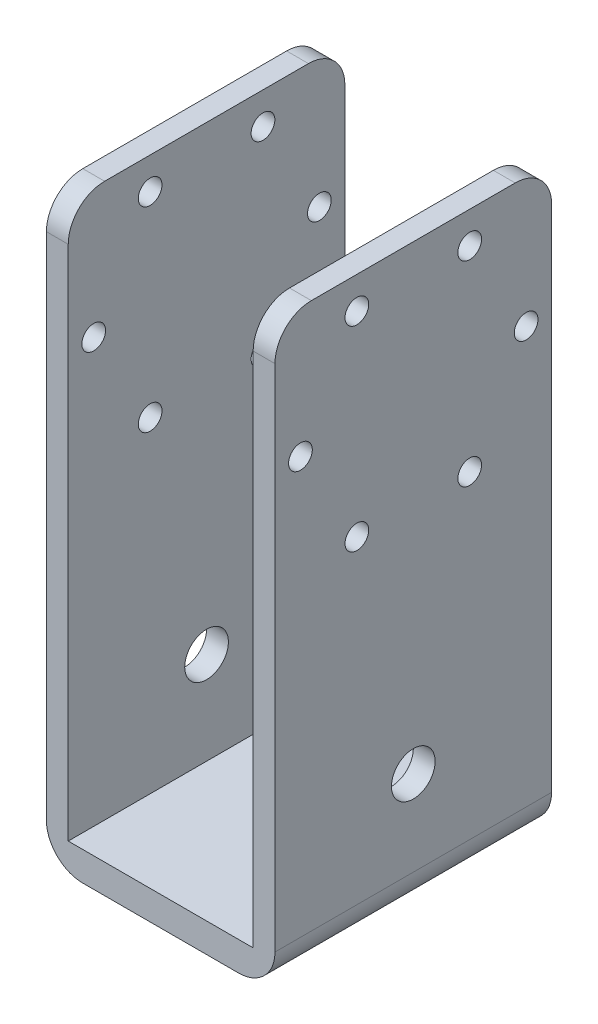
ISO-10303-21;
HEADER;
FILE_DESCRIPTION(('STEP AP214'),'2;1');
FILE_NAME('part.step','',(''),(''),'','','');
FILE_SCHEMA(('AUTOMOTIVE_DESIGN { 1 0 10303 214 1 1 1 1 }'));
ENDSEC;
DATA;
#1=APPLICATION_CONTEXT('core data for automotive mechanical design processes');
#2=APPLICATION_PROTOCOL_DEFINITION('international standard','automotive_design',2000,#1);
#3=PRODUCT_CONTEXT('',#1,'mechanical');
#4=PRODUCT('Part','Part','',(#3));
#5=PRODUCT_RELATED_PRODUCT_CATEGORY('part','',(#4));
#6=PRODUCT_DEFINITION_FORMATION('','',#4);
#7=PRODUCT_DEFINITION_CONTEXT('part definition',#1,'design');
#8=PRODUCT_DEFINITION('design','',#6,#7);
#9=PRODUCT_DEFINITION_SHAPE('','',#8);
#10=(LENGTH_UNIT() NAMED_UNIT(*) SI_UNIT(.MILLI.,.METRE.));
#11=(NAMED_UNIT(*) PLANE_ANGLE_UNIT() SI_UNIT($,.RADIAN.));
#12=(NAMED_UNIT(*) SI_UNIT($,.STERADIAN.) SOLID_ANGLE_UNIT());
#13=UNCERTAINTY_MEASURE_WITH_UNIT(LENGTH_MEASURE(1.E-05),#10,'distance_accuracy_value','');
#14=(GEOMETRIC_REPRESENTATION_CONTEXT(3) GLOBAL_UNCERTAINTY_ASSIGNED_CONTEXT((#13)) GLOBAL_UNIT_ASSIGNED_CONTEXT((#10,
#11,#12)) REPRESENTATION_CONTEXT('',''));
#15=CARTESIAN_POINT('',(0.,0.,0.));
#16=DIRECTION('',(0.,0.,1.));
#17=DIRECTION('',(1.,0.,0.));
#18=AXIS2_PLACEMENT_3D('',#15,#16,#17);
#19=CARTESIAN_POINT('',(-15.7,80.,19.));
#20=DIRECTION('',(1.,0.,0.));
#21=DIRECTION('',(0.,1.,0.));
#22=AXIS2_PLACEMENT_3D('',#19,#20,#21);
#23=PLANE('',#22);
#24=CARTESIAN_POINT('',(-15.7,16.7,0.));
#25=DIRECTION('',(1.,0.,0.));
#26=DIRECTION('',(0.,1.,0.));
#27=AXIS2_PLACEMENT_3D('',#24,#25,#26);
#28=CIRCLE('',#27,3.);
#29=CARTESIAN_POINT('',(-15.7,19.7,0.));
#30=VERTEX_POINT('',#29);
#31=EDGE_CURVE('E353',#30,#30,#28,.T.);
#32=ORIENTED_EDGE('',*,*,#31,.T.);
#33=EDGE_LOOP('',(#32));
#34=FACE_BOUND('',#33,.T.);
#35=CARTESIAN_POINT('',(-15.7,48.77,7.75000000000001));
#36=DIRECTION('',(1.,0.,0.));
#37=DIRECTION('',(0.,1.,0.));
#38=AXIS2_PLACEMENT_3D('',#35,#36,#37);
#39=CIRCLE('',#38,1.63);
#40=CARTESIAN_POINT('',(-15.7,50.4,7.75000000000001));
#41=VERTEX_POINT('',#40);
#42=EDGE_CURVE('E330',#41,#41,#39,.T.);
#43=ORIENTED_EDGE('',*,*,#42,.T.);
#44=EDGE_LOOP('',(#43));
#45=FACE_BOUND('',#44,.T.);
#46=CARTESIAN_POINT('',(-15.7,62.2,-15.5));
#47=DIRECTION('',(1.,0.,0.));
#48=DIRECTION('',(0.,-1.,0.));
#49=AXIS2_PLACEMENT_3D('',#46,#47,#48);
#50=CIRCLE('',#49,1.63);
#51=CARTESIAN_POINT('',(-15.7,60.57,-15.5));
#52=VERTEX_POINT('',#51);
#53=EDGE_CURVE('E337',#52,#52,#50,.T.);
#54=ORIENTED_EDGE('',*,*,#53,.T.);
#55=EDGE_LOOP('',(#54));
#56=FACE_BOUND('',#55,.T.);
#57=CARTESIAN_POINT('',(-15.7,62.2,15.5));
#58=DIRECTION('',(1.,0.,0.));
#59=DIRECTION('',(0.,1.,0.));
#60=AXIS2_PLACEMENT_3D('',#57,#58,#59);
#61=CIRCLE('',#60,1.63);
#62=CARTESIAN_POINT('',(-15.7,63.83,15.5));
#63=VERTEX_POINT('',#62);
#64=EDGE_CURVE('E318',#63,#63,#61,.T.);
#65=ORIENTED_EDGE('',*,*,#64,.T.);
#66=EDGE_LOOP('',(#65));
#67=FACE_BOUND('',#66,.T.);
#68=CARTESIAN_POINT('',(-15.7,75.63,-7.75));
#69=DIRECTION('',(1.,0.,0.));
#70=DIRECTION('',(0.,1.,0.));
#71=AXIS2_PLACEMENT_3D('',#68,#69,#70);
#72=CIRCLE('',#71,1.63);
#73=CARTESIAN_POINT('',(-15.7,77.26,-7.75));
#74=VERTEX_POINT('',#73);
#75=EDGE_CURVE('E325',#74,#74,#72,.T.);
#76=ORIENTED_EDGE('',*,*,#75,.T.);
#77=EDGE_LOOP('',(#76));
#78=FACE_BOUND('',#77,.T.);
#79=CARTESIAN_POINT('',(-15.7,48.77,-7.75000000000001));
#80=DIRECTION('',(1.,0.,0.));
#81=DIRECTION('',(0.,-1.,0.));
#82=AXIS2_PLACEMENT_3D('',#79,#80,#81);
#83=CIRCLE('',#82,1.63);
#84=CARTESIAN_POINT('',(-15.7,47.14,-7.75000000000001));
#85=VERTEX_POINT('',#84);
#86=EDGE_CURVE('E342',#85,#85,#83,.T.);
#87=ORIENTED_EDGE('',*,*,#86,.T.);
#88=EDGE_LOOP('',(#87));
#89=FACE_BOUND('',#88,.T.);
#90=CARTESIAN_POINT('',(-15.7,75.63,7.75000000000001));
#91=DIRECTION('',(1.,0.,0.));
#92=DIRECTION('',(0.,1.,0.));
#93=AXIS2_PLACEMENT_3D('',#90,#91,#92);
#94=CIRCLE('',#93,1.63);
#95=CARTESIAN_POINT('',(-15.7,77.26,7.75000000000001));
#96=VERTEX_POINT('',#95);
#97=EDGE_CURVE('E205',#96,#96,#94,.T.);
#98=ORIENTED_EDGE('',*,*,#97,.T.);
#99=EDGE_LOOP('',(#98));
#100=FACE_BOUND('',#99,.T.);
#101=DIRECTION('',(0.,-1.,0.));
#102=VECTOR('',#101,1.);
#103=CARTESIAN_POINT('',(-15.7,80.,-19.));
#104=LINE('',#103,#102);
#105=CARTESIAN_POINT('',(-15.7,75.,-19.));
#106=VERTEX_POINT('',#105);
#107=CARTESIAN_POINT('',(-15.7,5.,-19.));
#108=VERTEX_POINT('',#107);
#109=EDGE_CURVE('E173',#106,#108,#104,.T.);
#110=ORIENTED_EDGE('',*,*,#109,.T.);
#111=DIRECTION('',(0.,0.,-1.));
#112=VECTOR('',#111,1.);
#113=CARTESIAN_POINT('',(-15.7,5.,19.));
#114=LINE('',#113,#112);
#115=CARTESIAN_POINT('',(-15.7,5.,19.));
#116=VERTEX_POINT('',#115);
#117=EDGE_CURVE('E241',#108,#116,#114,.F.);
#118=ORIENTED_EDGE('',*,*,#117,.T.);
#119=DIRECTION('',(0.,-1.,0.));
#120=VECTOR('',#119,1.);
#121=CARTESIAN_POINT('',(-15.7,80.,19.));
#122=LINE('',#121,#120);
#123=CARTESIAN_POINT('',(-15.7,75.,19.));
#124=VERTEX_POINT('',#123);
#125=EDGE_CURVE('E189',#124,#116,#122,.T.);
#126=ORIENTED_EDGE('',*,*,#125,.F.);
#127=CARTESIAN_POINT('',(-15.7,75.,14.));
#128=DIRECTION('',(1.,0.,0.));
#129=DIRECTION('',(0.,1.,0.));
#130=AXIS2_PLACEMENT_3D('',#127,#128,#129);
#131=CIRCLE('',#130,5.);
#132=CARTESIAN_POINT('',(-15.7,80.,14.));
#133=VERTEX_POINT('',#132);
#134=EDGE_CURVE('E239',#124,#133,#131,.F.);
#135=ORIENTED_EDGE('',*,*,#134,.T.);
#136=DIRECTION('',(0.,0.,-1.));
#137=VECTOR('',#136,1.);
#138=CARTESIAN_POINT('',(-15.7,80.,19.));
#139=LINE('',#138,#137);
#140=CARTESIAN_POINT('',(-15.7,80.,-14.));
#141=VERTEX_POINT('',#140);
#142=EDGE_CURVE('E169',#133,#141,#139,.T.);
#143=ORIENTED_EDGE('',*,*,#142,.T.);
#144=CARTESIAN_POINT('',(-15.7,75.,-14.));
#145=DIRECTION('',(1.,0.,0.));
#146=DIRECTION('',(0.,1.,0.));
#147=AXIS2_PLACEMENT_3D('',#144,#145,#146);
#148=CIRCLE('',#147,5.);
#149=EDGE_CURVE('E237',#141,#106,#148,.F.);
#150=ORIENTED_EDGE('',*,*,#149,.T.);
#151=EDGE_LOOP('',(#110,#118,#126,#135,#143,#150));
#152=FACE_BOUND('',#151,.T.);
#153=ADVANCED_FACE('F41',(#34,#45,#56,#67,#78,#89,#100,#152),#23,.F.);
#154=CARTESIAN_POINT('',(-15.7,0.,19.));
#155=DIRECTION('',(0.,1.,0.));
#156=DIRECTION('',(-1.,0.,0.));
#157=AXIS2_PLACEMENT_3D('',#154,#155,#156);
#158=PLANE('',#157);
#159=DIRECTION('',(1.,0.,0.));
#160=VECTOR('',#159,1.);
#161=CARTESIAN_POINT('',(-15.7,0.,19.));
#162=LINE('',#161,#160);
#163=CARTESIAN_POINT('',(-10.7,0.,19.));
#164=VERTEX_POINT('',#163);
#165=CARTESIAN_POINT('',(10.7,0.,19.));
#166=VERTEX_POINT('',#165);
#167=EDGE_CURVE('E296',#164,#166,#162,.T.);
#168=ORIENTED_EDGE('',*,*,#167,.F.);
#169=DIRECTION('',(0.,0.,-1.));
#170=VECTOR('',#169,1.);
#171=CARTESIAN_POINT('',(-10.7,0.,19.));
#172=LINE('',#171,#170);
#173=CARTESIAN_POINT('',(-10.7,0.,-19.));
#174=VERTEX_POINT('',#173);
#175=EDGE_CURVE('E226',#164,#174,#172,.T.);
#176=ORIENTED_EDGE('',*,*,#175,.T.);
#177=DIRECTION('',(1.,0.,0.));
#178=VECTOR('',#177,1.);
#179=CARTESIAN_POINT('',(-15.7,0.,-19.));
#180=LINE('',#179,#178);
#181=CARTESIAN_POINT('',(10.7,0.,-19.));
#182=VERTEX_POINT('',#181);
#183=EDGE_CURVE('E176',#174,#182,#180,.T.);
#184=ORIENTED_EDGE('',*,*,#183,.T.);
#185=DIRECTION('',(0.,0.,-1.));
#186=VECTOR('',#185,1.);
#187=CARTESIAN_POINT('',(10.7,0.,19.));
#188=LINE('',#187,#186);
#189=EDGE_CURVE('E200',#182,#166,#188,.F.);
#190=ORIENTED_EDGE('',*,*,#189,.T.);
#191=EDGE_LOOP('',(#168,#176,#184,#190));
#192=FACE_BOUND('',#191,.T.);
#193=ADVANCED_FACE('F291',(#192),#158,.F.);
#194=CARTESIAN_POINT('',(15.7,80.,19.));
#195=DIRECTION('',(-1.,0.,0.));
#196=DIRECTION('',(0.,-1.,0.));
#197=AXIS2_PLACEMENT_3D('',#194,#195,#196);
#198=PLANE('',#197);
#199=CARTESIAN_POINT('',(15.7,16.7,0.));
#200=DIRECTION('',(1.,0.,0.));
#201=DIRECTION('',(0.,1.,0.));
#202=AXIS2_PLACEMENT_3D('',#199,#200,#201);
#203=CIRCLE('',#202,3.);
#204=CARTESIAN_POINT('',(15.7,19.7,0.));
#205=VERTEX_POINT('',#204);
#206=EDGE_CURVE('E350',#205,#205,#203,.T.);
#207=ORIENTED_EDGE('',*,*,#206,.F.);
#208=EDGE_LOOP('',(#207));
#209=FACE_BOUND('',#208,.T.);
#210=CARTESIAN_POINT('',(15.7,48.77,7.75000000000001));
#211=DIRECTION('',(1.,0.,0.));
#212=DIRECTION('',(0.,1.,0.));
#213=AXIS2_PLACEMENT_3D('',#210,#211,#212);
#214=CIRCLE('',#213,1.63);
#215=CARTESIAN_POINT('',(15.7,50.4,7.75000000000001));
#216=VERTEX_POINT('',#215);
#217=EDGE_CURVE('E333',#216,#216,#214,.T.);
#218=ORIENTED_EDGE('',*,*,#217,.F.);
#219=EDGE_LOOP('',(#218));
#220=FACE_BOUND('',#219,.T.);
#221=CARTESIAN_POINT('',(15.7,62.2,-15.5));
#222=DIRECTION('',(1.,0.,0.));
#223=DIRECTION('',(0.,-1.,0.));
#224=AXIS2_PLACEMENT_3D('',#221,#222,#223);
#225=CIRCLE('',#224,1.63);
#226=CARTESIAN_POINT('',(15.7,60.57,-15.5));
#227=VERTEX_POINT('',#226);
#228=EDGE_CURVE('E322',#227,#227,#225,.T.);
#229=ORIENTED_EDGE('',*,*,#228,.F.);
#230=EDGE_LOOP('',(#229));
#231=FACE_BOUND('',#230,.T.);
#232=CARTESIAN_POINT('',(15.7,62.2,15.5));
#233=DIRECTION('',(1.,0.,0.));
#234=DIRECTION('',(0.,1.,0.));
#235=AXIS2_PLACEMENT_3D('',#232,#233,#234);
#236=CIRCLE('',#235,1.63);
#237=CARTESIAN_POINT('',(15.7,63.83,15.5));
#238=VERTEX_POINT('',#237);
#239=EDGE_CURVE('E321',#238,#238,#236,.T.);
#240=ORIENTED_EDGE('',*,*,#239,.F.);
#241=EDGE_LOOP('',(#240));
#242=FACE_BOUND('',#241,.T.);
#243=CARTESIAN_POINT('',(15.7,75.63,-7.75));
#244=DIRECTION('',(1.,0.,0.));
#245=DIRECTION('',(0.,1.,0.));
#246=AXIS2_PLACEMENT_3D('',#243,#244,#245);
#247=CIRCLE('',#246,1.63);
#248=CARTESIAN_POINT('',(15.7,77.26,-7.75));
#249=VERTEX_POINT('',#248);
#250=EDGE_CURVE('E315',#249,#249,#247,.T.);
#251=ORIENTED_EDGE('',*,*,#250,.F.);
#252=EDGE_LOOP('',(#251));
#253=FACE_BOUND('',#252,.T.);
#254=CARTESIAN_POINT('',(15.7,48.77,-7.75000000000001));
#255=DIRECTION('',(1.,0.,0.));
#256=DIRECTION('',(0.,-1.,0.));
#257=AXIS2_PLACEMENT_3D('',#254,#255,#256);
#258=CIRCLE('',#257,1.63);
#259=CARTESIAN_POINT('',(15.7,47.14,-7.75000000000001));
#260=VERTEX_POINT('',#259);
#261=EDGE_CURVE('E334',#260,#260,#258,.T.);
#262=ORIENTED_EDGE('',*,*,#261,.F.);
#263=EDGE_LOOP('',(#262));
#264=FACE_BOUND('',#263,.T.);
#265=CARTESIAN_POINT('',(15.7,75.63,7.75000000000001));
#266=DIRECTION('',(1.,0.,0.));
#267=DIRECTION('',(0.,1.,0.));
#268=AXIS2_PLACEMENT_3D('',#265,#266,#267);
#269=CIRCLE('',#268,1.63);
#270=CARTESIAN_POINT('',(15.7,77.26,7.75000000000001));
#271=VERTEX_POINT('',#270);
#272=EDGE_CURVE('E312',#271,#271,#269,.T.);
#273=ORIENTED_EDGE('',*,*,#272,.F.);
#274=EDGE_LOOP('',(#273));
#275=FACE_BOUND('',#274,.T.);
#276=DIRECTION('',(0.,1.,0.));
#277=VECTOR('',#276,1.);
#278=CARTESIAN_POINT('',(15.7,80.,19.));
#279=LINE('',#278,#277);
#280=CARTESIAN_POINT('',(15.7,5.,19.));
#281=VERTEX_POINT('',#280);
#282=CARTESIAN_POINT('',(15.7,75.,19.));
#283=VERTEX_POINT('',#282);
#284=EDGE_CURVE('E152',#281,#283,#279,.T.);
#285=ORIENTED_EDGE('',*,*,#284,.F.);
#286=DIRECTION('',(0.,0.,-1.));
#287=VECTOR('',#286,1.);
#288=CARTESIAN_POINT('',(15.7,5.,19.));
#289=LINE('',#288,#287);
#290=CARTESIAN_POINT('',(15.7,5.,-19.));
#291=VERTEX_POINT('',#290);
#292=EDGE_CURVE('E255',#281,#291,#289,.T.);
#293=ORIENTED_EDGE('',*,*,#292,.T.);
#294=DIRECTION('',(0.,1.,0.));
#295=VECTOR('',#294,1.);
#296=CARTESIAN_POINT('',(15.7,80.,-19.));
#297=LINE('',#296,#295);
#298=CARTESIAN_POINT('',(15.7,75.,-19.));
#299=VERTEX_POINT('',#298);
#300=EDGE_CURVE('E180',#291,#299,#297,.T.);
#301=ORIENTED_EDGE('',*,*,#300,.T.);
#302=CARTESIAN_POINT('',(15.7,75.,-14.));
#303=DIRECTION('',(-1.,0.,0.));
#304=DIRECTION('',(0.,-1.,0.));
#305=AXIS2_PLACEMENT_3D('',#302,#303,#304);
#306=CIRCLE('',#305,5.);
#307=CARTESIAN_POINT('',(15.7,80.,-14.));
#308=VERTEX_POINT('',#307);
#309=EDGE_CURVE('E253',#299,#308,#306,.F.);
#310=ORIENTED_EDGE('',*,*,#309,.T.);
#311=DIRECTION('',(0.,0.,-1.));
#312=VECTOR('',#311,1.);
#313=CARTESIAN_POINT('',(15.7,80.,19.));
#314=LINE('',#313,#312);
#315=CARTESIAN_POINT('',(15.7,80.,14.));
#316=VERTEX_POINT('',#315);
#317=EDGE_CURVE('E197',#316,#308,#314,.T.);
#318=ORIENTED_EDGE('',*,*,#317,.F.);
#319=CARTESIAN_POINT('',(15.7,75.,14.));
#320=DIRECTION('',(-1.,0.,0.));
#321=DIRECTION('',(0.,-1.,0.));
#322=AXIS2_PLACEMENT_3D('',#319,#320,#321);
#323=CIRCLE('',#322,5.);
#324=EDGE_CURVE('E251',#316,#283,#323,.F.);
#325=ORIENTED_EDGE('',*,*,#324,.T.);
#326=EDGE_LOOP('',(#285,#293,#301,#310,#318,#325));
#327=FACE_BOUND('',#326,.T.);
#328=ADVANCED_FACE('F284',(#209,#220,#231,#242,#253,#264,#275,#327),#198,.F.);
#329=CARTESIAN_POINT('',(15.7,80.,19.));
#330=DIRECTION('',(0.,-1.,0.));
#331=DIRECTION('',(0.,0.,-1.));
#332=AXIS2_PLACEMENT_3D('',#329,#330,#331);
#333=PLANE('',#332);
#334=ORIENTED_EDGE('',*,*,#317,.T.);
#335=DIRECTION('',(-1.,0.,0.));
#336=VECTOR('',#335,1.);
#337=CARTESIAN_POINT('',(15.7,80.,-14.));
#338=LINE('',#337,#336);
#339=CARTESIAN_POINT('',(12.7,80.,-14.));
#340=VERTEX_POINT('',#339);
#341=EDGE_CURVE('E269',#308,#340,#338,.T.);
#342=ORIENTED_EDGE('',*,*,#341,.T.);
#343=DIRECTION('',(0.,0.,-1.));
#344=VECTOR('',#343,1.);
#345=CARTESIAN_POINT('',(12.7,80.,19.));
#346=LINE('',#345,#344);
#347=CARTESIAN_POINT('',(12.7,80.,14.));
#348=VERTEX_POINT('',#347);
#349=EDGE_CURVE('E161',#348,#340,#346,.T.);
#350=ORIENTED_EDGE('',*,*,#349,.F.);
#351=DIRECTION('',(-1.,0.,0.));
#352=VECTOR('',#351,1.);
#353=CARTESIAN_POINT('',(15.7,80.,14.));
#354=LINE('',#353,#352);
#355=EDGE_CURVE('E267',#348,#316,#354,.F.);
#356=ORIENTED_EDGE('',*,*,#355,.T.);
#357=EDGE_LOOP('',(#334,#342,#350,#356));
#358=FACE_BOUND('',#357,.T.);
#359=ADVANCED_FACE('F272',(#358),#333,.F.);
#360=CARTESIAN_POINT('',(12.7,80.,19.));
#361=DIRECTION('',(1.,0.,0.));
#362=DIRECTION('',(0.,1.,0.));
#363=AXIS2_PLACEMENT_3D('',#360,#361,#362);
#364=PLANE('',#363);
#365=CARTESIAN_POINT('',(12.7,16.7,0.));
#366=DIRECTION('',(1.,0.,0.));
#367=DIRECTION('',(0.,1.,0.));
#368=AXIS2_PLACEMENT_3D('',#365,#366,#367);
#369=CIRCLE('',#368,3.);
#370=CARTESIAN_POINT('',(12.7,19.7,0.));
#371=VERTEX_POINT('',#370);
#372=EDGE_CURVE('E345',#371,#371,#369,.T.);
#373=ORIENTED_EDGE('',*,*,#372,.T.);
#374=EDGE_LOOP('',(#373));
#375=FACE_BOUND('',#374,.T.);
#376=CARTESIAN_POINT('',(12.7,48.77,7.75000000000001));
#377=DIRECTION('',(1.,0.,0.));
#378=DIRECTION('',(0.,1.,0.));
#379=AXIS2_PLACEMENT_3D('',#376,#377,#378);
#380=CIRCLE('',#379,1.63);
#381=CARTESIAN_POINT('',(12.7,50.4,7.75000000000001));
#382=VERTEX_POINT('',#381);
#383=EDGE_CURVE('E177',#382,#382,#380,.T.);
#384=ORIENTED_EDGE('',*,*,#383,.T.);
#385=EDGE_LOOP('',(#384));
#386=FACE_BOUND('',#385,.T.);
#387=CARTESIAN_POINT('',(12.7,62.2,-15.5));
#388=DIRECTION('',(1.,0.,0.));
#389=DIRECTION('',(0.,1.,0.));
#390=AXIS2_PLACEMENT_3D('',#387,#388,#389);
#391=CIRCLE('',#390,1.63);
#392=CARTESIAN_POINT('',(12.7,63.83,-15.5));
#393=VERTEX_POINT('',#392);
#394=EDGE_CURVE('E221',#393,#393,#391,.T.);
#395=ORIENTED_EDGE('',*,*,#394,.T.);
#396=EDGE_LOOP('',(#395));
#397=FACE_BOUND('',#396,.T.);
#398=CARTESIAN_POINT('',(12.7,62.2,15.5));
#399=DIRECTION('',(1.,0.,0.));
#400=DIRECTION('',(0.,1.,0.));
#401=AXIS2_PLACEMENT_3D('',#398,#399,#400);
#402=CIRCLE('',#401,1.63);
#403=CARTESIAN_POINT('',(12.7,63.83,15.5));
#404=VERTEX_POINT('',#403);
#405=EDGE_CURVE('E217',#404,#404,#402,.T.);
#406=ORIENTED_EDGE('',*,*,#405,.T.);
#407=EDGE_LOOP('',(#406));
#408=FACE_BOUND('',#407,.T.);
#409=CARTESIAN_POINT('',(12.7,75.63,-7.75));
#410=DIRECTION('',(1.,0.,0.));
#411=DIRECTION('',(0.,1.,0.));
#412=AXIS2_PLACEMENT_3D('',#409,#410,#411);
#413=CIRCLE('',#412,1.63);
#414=CARTESIAN_POINT('',(12.7,77.26,-7.75));
#415=VERTEX_POINT('',#414);
#416=EDGE_CURVE('E213',#415,#415,#413,.T.);
#417=ORIENTED_EDGE('',*,*,#416,.T.);
#418=EDGE_LOOP('',(#417));
#419=FACE_BOUND('',#418,.T.);
#420=CARTESIAN_POINT('',(12.7,48.77,-7.75000000000001));
#421=DIRECTION('',(1.,0.,0.));
#422=DIRECTION('',(0.,1.,0.));
#423=AXIS2_PLACEMENT_3D('',#420,#421,#422);
#424=CIRCLE('',#423,1.63);
#425=CARTESIAN_POINT('',(12.7,50.4,-7.75000000000001));
#426=VERTEX_POINT('',#425);
#427=EDGE_CURVE('E209',#426,#426,#424,.T.);
#428=ORIENTED_EDGE('',*,*,#427,.T.);
#429=EDGE_LOOP('',(#428));
#430=FACE_BOUND('',#429,.T.);
#431=CARTESIAN_POINT('',(12.7,75.63,7.75000000000001));
#432=DIRECTION('',(1.,0.,0.));
#433=DIRECTION('',(0.,1.,0.));
#434=AXIS2_PLACEMENT_3D('',#431,#432,#433);
#435=CIRCLE('',#434,1.63);
#436=CARTESIAN_POINT('',(12.7,77.26,7.75000000000001));
#437=VERTEX_POINT('',#436);
#438=EDGE_CURVE('E204',#437,#437,#435,.T.);
#439=ORIENTED_EDGE('',*,*,#438,.T.);
#440=EDGE_LOOP('',(#439));
#441=FACE_BOUND('',#440,.T.);
#442=ORIENTED_EDGE('',*,*,#349,.T.);
#443=CARTESIAN_POINT('',(12.7,75.,-14.));
#444=DIRECTION('',(1.,0.,0.));
#445=DIRECTION('',(0.,1.,0.));
#446=AXIS2_PLACEMENT_3D('',#443,#444,#445);
#447=CIRCLE('',#446,5.);
#448=CARTESIAN_POINT('',(12.7,75.,-19.));
#449=VERTEX_POINT('',#448);
#450=EDGE_CURVE('E11',#340,#449,#447,.F.);
#451=ORIENTED_EDGE('',*,*,#450,.T.);
#452=DIRECTION('',(0.,-1.,0.));
#453=VECTOR('',#452,1.);
#454=CARTESIAN_POINT('',(12.7,80.,-19.));
#455=LINE('',#454,#453);
#456=CARTESIAN_POINT('',(12.7,4.,-19.));
#457=VERTEX_POINT('',#456);
#458=EDGE_CURVE('E158',#449,#457,#455,.T.);
#459=ORIENTED_EDGE('',*,*,#458,.T.);
#460=DIRECTION('',(0.,0.,-1.));
#461=VECTOR('',#460,1.);
#462=CARTESIAN_POINT('',(12.7,4.,19.));
#463=LINE('',#462,#461);
#464=CARTESIAN_POINT('',(12.7,4.,19.));
#465=VERTEX_POINT('',#464);
#466=EDGE_CURVE('E155',#465,#457,#463,.T.);
#467=ORIENTED_EDGE('',*,*,#466,.F.);
#468=DIRECTION('',(0.,-1.,0.));
#469=VECTOR('',#468,1.);
#470=CARTESIAN_POINT('',(12.7,80.,19.));
#471=LINE('',#470,#469);
#472=CARTESIAN_POINT('',(12.7,75.,19.));
#473=VERTEX_POINT('',#472);
#474=EDGE_CURVE('E141',#473,#465,#471,.T.);
#475=ORIENTED_EDGE('',*,*,#474,.F.);
#476=CARTESIAN_POINT('',(12.7,75.,14.));
#477=DIRECTION('',(1.,0.,0.));
#478=DIRECTION('',(0.,1.,0.));
#479=AXIS2_PLACEMENT_3D('',#476,#477,#478);
#480=CIRCLE('',#479,5.);
#481=EDGE_CURVE('E50',#473,#348,#480,.F.);
#482=ORIENTED_EDGE('',*,*,#481,.T.);
#483=EDGE_LOOP('',(#442,#451,#459,#467,#475,#482));
#484=FACE_BOUND('',#483,.T.);
#485=ADVANCED_FACE('F156',(#375,#386,#397,#408,#419,#430,#441,#484),#364,.F.);
#486=CARTESIAN_POINT('',(-12.7,4.,19.));
#487=DIRECTION('',(0.,-1.,0.));
#488=DIRECTION('',(1.,0.,0.));
#489=AXIS2_PLACEMENT_3D('',#486,#487,#488);
#490=PLANE('',#489);
#491=DIRECTION('',(-1.,0.,0.));
#492=VECTOR('',#491,1.);
#493=CARTESIAN_POINT('',(-12.7,4.,-19.));
#494=LINE('',#493,#492);
#495=CARTESIAN_POINT('',(-12.7,4.,-19.));
#496=VERTEX_POINT('',#495);
#497=EDGE_CURVE('E184',#457,#496,#494,.T.);
#498=ORIENTED_EDGE('',*,*,#497,.T.);
#499=DIRECTION('',(0.,0.,-1.));
#500=VECTOR('',#499,1.);
#501=CARTESIAN_POINT('',(-12.7,4.,19.));
#502=LINE('',#501,#500);
#503=CARTESIAN_POINT('',(-12.7,4.,19.));
#504=VERTEX_POINT('',#503);
#505=EDGE_CURVE('E162',#504,#496,#502,.T.);
#506=ORIENTED_EDGE('',*,*,#505,.F.);
#507=DIRECTION('',(-1.,0.,0.));
#508=VECTOR('',#507,1.);
#509=CARTESIAN_POINT('',(-12.7,4.,19.));
#510=LINE('',#509,#508);
#511=EDGE_CURVE('E147',#465,#504,#510,.T.);
#512=ORIENTED_EDGE('',*,*,#511,.F.);
#513=ORIENTED_EDGE('',*,*,#466,.T.);
#514=EDGE_LOOP('',(#498,#506,#512,#513));
#515=FACE_BOUND('',#514,.T.);
#516=ADVANCED_FACE('F164',(#515),#490,.F.);
#517=CARTESIAN_POINT('',(-12.7,80.,19.));
#518=DIRECTION('',(-1.,0.,0.));
#519=DIRECTION('',(0.,-1.,0.));
#520=AXIS2_PLACEMENT_3D('',#517,#518,#519);
#521=PLANE('',#520);
#522=CARTESIAN_POINT('',(-12.7,16.7,0.));
#523=DIRECTION('',(-1.,0.,0.));
#524=DIRECTION('',(0.,-1.,0.));
#525=AXIS2_PLACEMENT_3D('',#522,#523,#524);
#526=CIRCLE('',#525,3.);
#527=CARTESIAN_POINT('',(-12.7,13.7,0.));
#528=VERTEX_POINT('',#527);
#529=EDGE_CURVE('E45',#528,#528,#526,.T.);
#530=ORIENTED_EDGE('',*,*,#529,.T.);
#531=EDGE_LOOP('',(#530));
#532=FACE_BOUND('',#531,.T.);
#533=CARTESIAN_POINT('',(-12.7,48.77,7.75000000000001));
#534=DIRECTION('',(-1.,0.,0.));
#535=DIRECTION('',(0.,-1.,0.));
#536=AXIS2_PLACEMENT_3D('',#533,#534,#535);
#537=CIRCLE('',#536,1.63);
#538=CARTESIAN_POINT('',(-12.7,47.14,7.75000000000001));
#539=VERTEX_POINT('',#538);
#540=EDGE_CURVE('E222',#539,#539,#537,.T.);
#541=ORIENTED_EDGE('',*,*,#540,.T.);
#542=EDGE_LOOP('',(#541));
#543=FACE_BOUND('',#542,.T.);
#544=CARTESIAN_POINT('',(-12.7,62.2,-15.5));
#545=DIRECTION('',(-1.,0.,0.));
#546=DIRECTION('',(0.,-1.,0.));
#547=AXIS2_PLACEMENT_3D('',#544,#545,#546);
#548=CIRCLE('',#547,1.63);
#549=CARTESIAN_POINT('',(-12.7,60.57,-15.5));
#550=VERTEX_POINT('',#549);
#551=EDGE_CURVE('E218',#550,#550,#548,.T.);
#552=ORIENTED_EDGE('',*,*,#551,.T.);
#553=EDGE_LOOP('',(#552));
#554=FACE_BOUND('',#553,.T.);
#555=CARTESIAN_POINT('',(-12.7,62.2,15.5));
#556=DIRECTION('',(-1.,0.,0.));
#557=DIRECTION('',(0.,-1.,0.));
#558=AXIS2_PLACEMENT_3D('',#555,#556,#557);
#559=CIRCLE('',#558,1.63);
#560=CARTESIAN_POINT('',(-12.7,60.57,15.5));
#561=VERTEX_POINT('',#560);
#562=EDGE_CURVE('E214',#561,#561,#559,.T.);
#563=ORIENTED_EDGE('',*,*,#562,.T.);
#564=EDGE_LOOP('',(#563));
#565=FACE_BOUND('',#564,.T.);
#566=CARTESIAN_POINT('',(-12.7,75.63,-7.75));
#567=DIRECTION('',(-1.,0.,0.));
#568=DIRECTION('',(0.,-1.,0.));
#569=AXIS2_PLACEMENT_3D('',#566,#567,#568);
#570=CIRCLE('',#569,1.63);
#571=CARTESIAN_POINT('',(-12.7,74.,-7.75));
#572=VERTEX_POINT('',#571);
#573=EDGE_CURVE('E210',#572,#572,#570,.T.);
#574=ORIENTED_EDGE('',*,*,#573,.T.);
#575=EDGE_LOOP('',(#574));
#576=FACE_BOUND('',#575,.T.);
#577=CARTESIAN_POINT('',(-12.7,48.77,-7.75000000000001));
#578=DIRECTION('',(-1.,0.,0.));
#579=DIRECTION('',(0.,-1.,0.));
#580=AXIS2_PLACEMENT_3D('',#577,#578,#579);
#581=CIRCLE('',#580,1.63);
#582=CARTESIAN_POINT('',(-12.7,47.14,-7.75000000000001));
#583=VERTEX_POINT('',#582);
#584=EDGE_CURVE('E206',#583,#583,#581,.T.);
#585=ORIENTED_EDGE('',*,*,#584,.T.);
#586=EDGE_LOOP('',(#585));
#587=FACE_BOUND('',#586,.T.);
#588=CARTESIAN_POINT('',(-12.7,75.63,7.75000000000001));
#589=DIRECTION('',(-1.,0.,0.));
#590=DIRECTION('',(0.,-1.,0.));
#591=AXIS2_PLACEMENT_3D('',#588,#589,#590);
#592=CIRCLE('',#591,1.63);
#593=CARTESIAN_POINT('',(-12.7,74.,7.75000000000001));
#594=VERTEX_POINT('',#593);
#595=EDGE_CURVE('E201',#594,#594,#592,.T.);
#596=ORIENTED_EDGE('',*,*,#595,.T.);
#597=EDGE_LOOP('',(#596));
#598=FACE_BOUND('',#597,.T.);
#599=DIRECTION('',(0.,0.,-1.));
#600=VECTOR('',#599,1.);
#601=CARTESIAN_POINT('',(-12.7,80.,19.));
#602=LINE('',#601,#600);
#603=CARTESIAN_POINT('',(-12.7,80.,14.));
#604=VERTEX_POINT('',#603);
#605=CARTESIAN_POINT('',(-12.7,80.,-14.));
#606=VERTEX_POINT('',#605);
#607=EDGE_CURVE('E192',#604,#606,#602,.T.);
#608=ORIENTED_EDGE('',*,*,#607,.F.);
#609=CARTESIAN_POINT('',(-12.7,75.,14.));
#610=DIRECTION('',(-1.,0.,0.));
#611=DIRECTION('',(0.,-1.,0.));
#612=AXIS2_PLACEMENT_3D('',#609,#610,#611);
#613=CIRCLE('',#612,5.);
#614=CARTESIAN_POINT('',(-12.7,75.,19.));
#615=VERTEX_POINT('',#614);
#616=EDGE_CURVE('E265',#604,#615,#613,.F.);
#617=ORIENTED_EDGE('',*,*,#616,.T.);
#618=DIRECTION('',(0.,1.,0.));
#619=VECTOR('',#618,1.);
#620=CARTESIAN_POINT('',(-12.7,80.,19.));
#621=LINE('',#620,#619);
#622=EDGE_CURVE('E167',#504,#615,#621,.T.);
#623=ORIENTED_EDGE('',*,*,#622,.F.);
#624=ORIENTED_EDGE('',*,*,#505,.T.);
#625=DIRECTION('',(0.,1.,0.));
#626=VECTOR('',#625,1.);
#627=CARTESIAN_POINT('',(-12.7,80.,-19.));
#628=LINE('',#627,#626);
#629=CARTESIAN_POINT('',(-12.7,75.,-19.));
#630=VERTEX_POINT('',#629);
#631=EDGE_CURVE('E186',#496,#630,#628,.T.);
#632=ORIENTED_EDGE('',*,*,#631,.T.);
#633=CARTESIAN_POINT('',(-12.7,75.,-14.));
#634=DIRECTION('',(-1.,0.,0.));
#635=DIRECTION('',(0.,-1.,0.));
#636=AXIS2_PLACEMENT_3D('',#633,#634,#635);
#637=CIRCLE('',#636,5.);
#638=EDGE_CURVE('E263',#630,#606,#637,.F.);
#639=ORIENTED_EDGE('',*,*,#638,.T.);
#640=EDGE_LOOP('',(#608,#617,#623,#624,#632,#639));
#641=FACE_BOUND('',#640,.T.);
#642=ADVANCED_FACE('F360',(#532,#543,#554,#565,#576,#587,#598,#641),#521,.F.);
#643=CARTESIAN_POINT('',(-15.7,80.,19.));
#644=DIRECTION('',(0.,-1.,0.));
#645=DIRECTION('',(0.,0.,-1.));
#646=AXIS2_PLACEMENT_3D('',#643,#644,#645);
#647=PLANE('',#646);
#648=ORIENTED_EDGE('',*,*,#142,.F.);
#649=DIRECTION('',(-1.,0.,0.));
#650=VECTOR('',#649,1.);
#651=CARTESIAN_POINT('',(-12.7,80.,14.));
#652=LINE('',#651,#650);
#653=EDGE_CURVE('E261',#133,#604,#652,.F.);
#654=ORIENTED_EDGE('',*,*,#653,.T.);
#655=ORIENTED_EDGE('',*,*,#607,.T.);
#656=DIRECTION('',(-1.,0.,0.));
#657=VECTOR('',#656,1.);
#658=CARTESIAN_POINT('',(-15.7,80.,-14.));
#659=LINE('',#658,#657);
#660=EDGE_CURVE('E258',#606,#141,#659,.T.);
#661=ORIENTED_EDGE('',*,*,#660,.T.);
#662=EDGE_LOOP('',(#648,#654,#655,#661));
#663=FACE_BOUND('',#662,.T.);
#664=ADVANCED_FACE('F446',(#663),#647,.F.);
#665=CARTESIAN_POINT('',(0.,0.,19.));
#666=DIRECTION('',(0.,0.,1.));
#667=DIRECTION('',(1.,0.,0.));
#668=AXIS2_PLACEMENT_3D('',#665,#666,#667);
#669=PLANE('',#668);
#670=ORIENTED_EDGE('',*,*,#125,.T.);
#671=CARTESIAN_POINT('',(-10.7,5.,19.));
#672=DIRECTION('',(0.,0.,1.));
#673=DIRECTION('',(1.,0.,0.));
#674=AXIS2_PLACEMENT_3D('',#671,#672,#673);
#675=CIRCLE('',#674,5.);
#676=EDGE_CURVE('E249',#116,#164,#675,.T.);
#677=ORIENTED_EDGE('',*,*,#676,.T.);
#678=ORIENTED_EDGE('',*,*,#167,.T.);
#679=CARTESIAN_POINT('',(10.7,5.,19.));
#680=DIRECTION('',(0.,0.,1.));
#681=DIRECTION('',(1.,0.,0.));
#682=AXIS2_PLACEMENT_3D('',#679,#680,#681);
#683=CIRCLE('',#682,5.);
#684=EDGE_CURVE('E247',#166,#281,#683,.T.);
#685=ORIENTED_EDGE('',*,*,#684,.T.);
#686=ORIENTED_EDGE('',*,*,#284,.T.);
#687=DIRECTION('',(-1.,0.,0.));
#688=VECTOR('',#687,1.);
#689=CARTESIAN_POINT('',(12.7,75.,19.));
#690=LINE('',#689,#688);
#691=EDGE_CURVE('E151',#283,#473,#690,.T.);
#692=ORIENTED_EDGE('',*,*,#691,.T.);
#693=ORIENTED_EDGE('',*,*,#474,.T.);
#694=ORIENTED_EDGE('',*,*,#511,.T.);
#695=ORIENTED_EDGE('',*,*,#622,.T.);
#696=DIRECTION('',(-1.,0.,0.));
#697=VECTOR('',#696,1.);
#698=CARTESIAN_POINT('',(-15.7,75.,19.));
#699=LINE('',#698,#697);
#700=EDGE_CURVE('E244',#615,#124,#699,.T.);
#701=ORIENTED_EDGE('',*,*,#700,.T.);
#702=EDGE_LOOP('',(#670,#677,#678,#685,#686,#692,#693,#694,#695,#701));
#703=FACE_BOUND('',#702,.T.);
#704=ADVANCED_FACE('F144',(#703),#669,.T.);
#705=CARTESIAN_POINT('',(0.,0.,-19.));
#706=DIRECTION('',(0.,0.,1.));
#707=DIRECTION('',(1.,0.,0.));
#708=AXIS2_PLACEMENT_3D('',#705,#706,#707);
#709=PLANE('',#708);
#710=ORIENTED_EDGE('',*,*,#183,.F.);
#711=CARTESIAN_POINT('',(-10.7,5.,-19.));
#712=DIRECTION('',(0.,0.,1.));
#713=DIRECTION('',(1.,0.,0.));
#714=AXIS2_PLACEMENT_3D('',#711,#712,#713);
#715=CIRCLE('',#714,5.);
#716=EDGE_CURVE('E235',#174,#108,#715,.F.);
#717=ORIENTED_EDGE('',*,*,#716,.T.);
#718=ORIENTED_EDGE('',*,*,#109,.F.);
#719=DIRECTION('',(-1.,0.,0.));
#720=VECTOR('',#719,1.);
#721=CARTESIAN_POINT('',(0.,75.,-19.));
#722=LINE('',#721,#720);
#723=EDGE_CURVE('E231',#106,#630,#722,.F.);
#724=ORIENTED_EDGE('',*,*,#723,.T.);
#725=ORIENTED_EDGE('',*,*,#631,.F.);
#726=ORIENTED_EDGE('',*,*,#497,.F.);
#727=ORIENTED_EDGE('',*,*,#458,.F.);
#728=DIRECTION('',(-1.,0.,0.));
#729=VECTOR('',#728,1.);
#730=CARTESIAN_POINT('',(0.,75.,-19.));
#731=LINE('',#730,#729);
#732=EDGE_CURVE('E229',#449,#299,#731,.F.);
#733=ORIENTED_EDGE('',*,*,#732,.T.);
#734=ORIENTED_EDGE('',*,*,#300,.F.);
#735=CARTESIAN_POINT('',(10.7,5.,-19.));
#736=DIRECTION('',(0.,0.,1.));
#737=DIRECTION('',(1.,0.,0.));
#738=AXIS2_PLACEMENT_3D('',#735,#736,#737);
#739=CIRCLE('',#738,5.);
#740=EDGE_CURVE('E233',#291,#182,#739,.F.);
#741=ORIENTED_EDGE('',*,*,#740,.T.);
#742=EDGE_LOOP('',(#710,#717,#718,#724,#725,#726,#727,#733,#734,#741));
#743=FACE_BOUND('',#742,.T.);
#744=ADVANCED_FACE('F278',(#743),#709,.F.);
#745=CARTESIAN_POINT('',(-15.7,75.63,7.75000000000001));
#746=DIRECTION('',(1.,0.,0.));
#747=DIRECTION('',(0.,1.,0.));
#748=AXIS2_PLACEMENT_3D('',#745,#746,#747);
#749=CYLINDRICAL_SURFACE('',#748,1.63);
#750=ORIENTED_EDGE('',*,*,#97,.F.);
#751=EDGE_LOOP('',(#750));
#752=FACE_BOUND('',#751,.T.);
#753=ORIENTED_EDGE('',*,*,#595,.F.);
#754=EDGE_LOOP('',(#753));
#755=FACE_BOUND('',#754,.T.);
#756=ADVANCED_FACE('F556',(#752,#755),#749,.F.);
#757=CARTESIAN_POINT('',(-15.7,48.77,-7.75000000000001));
#758=DIRECTION('',(1.,0.,0.));
#759=DIRECTION('',(0.,1.,0.));
#760=AXIS2_PLACEMENT_3D('',#757,#758,#759);
#761=CYLINDRICAL_SURFACE('',#760,1.63);
#762=ORIENTED_EDGE('',*,*,#86,.F.);
#763=EDGE_LOOP('',(#762));
#764=FACE_BOUND('',#763,.T.);
#765=ORIENTED_EDGE('',*,*,#584,.F.);
#766=EDGE_LOOP('',(#765));
#767=FACE_BOUND('',#766,.T.);
#768=ADVANCED_FACE('F546',(#764,#767),#761,.F.);
#769=CARTESIAN_POINT('',(-15.7,75.63,-7.75));
#770=DIRECTION('',(1.,0.,0.));
#771=DIRECTION('',(0.,1.,0.));
#772=AXIS2_PLACEMENT_3D('',#769,#770,#771);
#773=CYLINDRICAL_SURFACE('',#772,1.63);
#774=ORIENTED_EDGE('',*,*,#75,.F.);
#775=EDGE_LOOP('',(#774));
#776=FACE_BOUND('',#775,.T.);
#777=ORIENTED_EDGE('',*,*,#573,.F.);
#778=EDGE_LOOP('',(#777));
#779=FACE_BOUND('',#778,.T.);
#780=ADVANCED_FACE('F536',(#776,#779),#773,.F.);
#781=CARTESIAN_POINT('',(-15.7,62.2,15.5));
#782=DIRECTION('',(1.,0.,0.));
#783=DIRECTION('',(0.,1.,0.));
#784=AXIS2_PLACEMENT_3D('',#781,#782,#783);
#785=CYLINDRICAL_SURFACE('',#784,1.63);
#786=ORIENTED_EDGE('',*,*,#64,.F.);
#787=EDGE_LOOP('',(#786));
#788=FACE_BOUND('',#787,.T.);
#789=ORIENTED_EDGE('',*,*,#562,.F.);
#790=EDGE_LOOP('',(#789));
#791=FACE_BOUND('',#790,.T.);
#792=ADVANCED_FACE('F525',(#788,#791),#785,.F.);
#793=CARTESIAN_POINT('',(-15.7,62.2,-15.5));
#794=DIRECTION('',(1.,0.,0.));
#795=DIRECTION('',(0.,1.,0.));
#796=AXIS2_PLACEMENT_3D('',#793,#794,#795);
#797=CYLINDRICAL_SURFACE('',#796,1.63);
#798=ORIENTED_EDGE('',*,*,#53,.F.);
#799=EDGE_LOOP('',(#798));
#800=FACE_BOUND('',#799,.T.);
#801=ORIENTED_EDGE('',*,*,#551,.F.);
#802=EDGE_LOOP('',(#801));
#803=FACE_BOUND('',#802,.T.);
#804=ADVANCED_FACE('F514',(#800,#803),#797,.F.);
#805=CARTESIAN_POINT('',(-15.7,48.77,7.75000000000001));
#806=DIRECTION('',(1.,0.,0.));
#807=DIRECTION('',(0.,1.,0.));
#808=AXIS2_PLACEMENT_3D('',#805,#806,#807);
#809=CYLINDRICAL_SURFACE('',#808,1.63);
#810=ORIENTED_EDGE('',*,*,#42,.F.);
#811=EDGE_LOOP('',(#810));
#812=FACE_BOUND('',#811,.T.);
#813=ORIENTED_EDGE('',*,*,#540,.F.);
#814=EDGE_LOOP('',(#813));
#815=FACE_BOUND('',#814,.T.);
#816=ADVANCED_FACE('F503',(#812,#815),#809,.F.);
#817=ORIENTED_EDGE('',*,*,#272,.T.);
#818=EDGE_LOOP('',(#817));
#819=FACE_BOUND('',#818,.T.);
#820=ORIENTED_EDGE('',*,*,#438,.F.);
#821=EDGE_LOOP('',(#820));
#822=FACE_BOUND('',#821,.T.);
#823=ADVANCED_FACE('F544',(#819,#822),#749,.F.);
#824=ORIENTED_EDGE('',*,*,#261,.T.);
#825=EDGE_LOOP('',(#824));
#826=FACE_BOUND('',#825,.T.);
#827=ORIENTED_EDGE('',*,*,#427,.F.);
#828=EDGE_LOOP('',(#827));
#829=FACE_BOUND('',#828,.T.);
#830=ADVANCED_FACE('F533',(#826,#829),#761,.F.);
#831=ORIENTED_EDGE('',*,*,#250,.T.);
#832=EDGE_LOOP('',(#831));
#833=FACE_BOUND('',#832,.T.);
#834=ORIENTED_EDGE('',*,*,#416,.F.);
#835=EDGE_LOOP('',(#834));
#836=FACE_BOUND('',#835,.T.);
#837=ADVANCED_FACE('F522',(#833,#836),#773,.F.);
#838=ORIENTED_EDGE('',*,*,#239,.T.);
#839=EDGE_LOOP('',(#838));
#840=FACE_BOUND('',#839,.T.);
#841=ORIENTED_EDGE('',*,*,#405,.F.);
#842=EDGE_LOOP('',(#841));
#843=FACE_BOUND('',#842,.T.);
#844=ADVANCED_FACE('F511',(#840,#843),#785,.F.);
#845=ORIENTED_EDGE('',*,*,#228,.T.);
#846=EDGE_LOOP('',(#845));
#847=FACE_BOUND('',#846,.T.);
#848=ORIENTED_EDGE('',*,*,#394,.F.);
#849=EDGE_LOOP('',(#848));
#850=FACE_BOUND('',#849,.T.);
#851=ADVANCED_FACE('F500',(#847,#850),#797,.F.);
#852=ORIENTED_EDGE('',*,*,#217,.T.);
#853=EDGE_LOOP('',(#852));
#854=FACE_BOUND('',#853,.T.);
#855=ORIENTED_EDGE('',*,*,#383,.F.);
#856=EDGE_LOOP('',(#855));
#857=FACE_BOUND('',#856,.T.);
#858=ADVANCED_FACE('F387',(#854,#857),#809,.F.);
#859=CARTESIAN_POINT('',(-10.7,5.,19.));
#860=DIRECTION('',(0.,0.,-1.));
#861=DIRECTION('',(-1.,0.,0.));
#862=AXIS2_PLACEMENT_3D('',#859,#860,#861);
#863=CYLINDRICAL_SURFACE('',#862,5.);
#864=ORIENTED_EDGE('',*,*,#676,.F.);
#865=ORIENTED_EDGE('',*,*,#117,.F.);
#866=ORIENTED_EDGE('',*,*,#716,.F.);
#867=ORIENTED_EDGE('',*,*,#175,.F.);
#868=EDGE_LOOP('',(#864,#865,#866,#867));
#869=FACE_BOUND('',#868,.T.);
#870=ADVANCED_FACE('F384',(#869),#863,.T.);
#871=CARTESIAN_POINT('',(10.7,5.,19.));
#872=DIRECTION('',(0.,0.,-1.));
#873=DIRECTION('',(-1.,0.,0.));
#874=AXIS2_PLACEMENT_3D('',#871,#872,#873);
#875=CYLINDRICAL_SURFACE('',#874,5.);
#876=ORIENTED_EDGE('',*,*,#684,.F.);
#877=ORIENTED_EDGE('',*,*,#189,.F.);
#878=ORIENTED_EDGE('',*,*,#740,.F.);
#879=ORIENTED_EDGE('',*,*,#292,.F.);
#880=EDGE_LOOP('',(#876,#877,#878,#879));
#881=FACE_BOUND('',#880,.T.);
#882=ADVANCED_FACE('F295',(#881),#875,.T.);
#883=CARTESIAN_POINT('',(0.,75.,14.));
#884=DIRECTION('',(1.,0.,0.));
#885=DIRECTION('',(0.,0.,-1.));
#886=AXIS2_PLACEMENT_3D('',#883,#884,#885);
#887=CYLINDRICAL_SURFACE('',#886,5.);
#888=ORIENTED_EDGE('',*,*,#616,.F.);
#889=ORIENTED_EDGE('',*,*,#653,.F.);
#890=ORIENTED_EDGE('',*,*,#134,.F.);
#891=ORIENTED_EDGE('',*,*,#700,.F.);
#892=EDGE_LOOP('',(#888,#889,#890,#891));
#893=FACE_BOUND('',#892,.T.);
#894=ADVANCED_FACE('F391',(#893),#887,.T.);
#895=CARTESIAN_POINT('',(-15.7,75.,-14.));
#896=DIRECTION('',(-1.,0.,0.));
#897=DIRECTION('',(0.,0.,1.));
#898=AXIS2_PLACEMENT_3D('',#895,#896,#897);
#899=CYLINDRICAL_SURFACE('',#898,5.);
#900=ORIENTED_EDGE('',*,*,#638,.F.);
#901=ORIENTED_EDGE('',*,*,#723,.F.);
#902=ORIENTED_EDGE('',*,*,#149,.F.);
#903=ORIENTED_EDGE('',*,*,#660,.F.);
#904=EDGE_LOOP('',(#900,#901,#902,#903));
#905=FACE_BOUND('',#904,.T.);
#906=ADVANCED_FACE('F394',(#905),#899,.T.);
#907=CARTESIAN_POINT('',(15.7,75.,-14.));
#908=DIRECTION('',(-1.,0.,0.));
#909=DIRECTION('',(0.,0.,1.));
#910=AXIS2_PLACEMENT_3D('',#907,#908,#909);
#911=CYLINDRICAL_SURFACE('',#910,5.);
#912=ORIENTED_EDGE('',*,*,#309,.F.);
#913=ORIENTED_EDGE('',*,*,#732,.F.);
#914=ORIENTED_EDGE('',*,*,#450,.F.);
#915=ORIENTED_EDGE('',*,*,#341,.F.);
#916=EDGE_LOOP('',(#912,#913,#914,#915));
#917=FACE_BOUND('',#916,.T.);
#918=ADVANCED_FACE('F281',(#917),#911,.T.);
#919=CARTESIAN_POINT('',(0.,75.,14.));
#920=DIRECTION('',(1.,0.,0.));
#921=DIRECTION('',(0.,0.,-1.));
#922=AXIS2_PLACEMENT_3D('',#919,#920,#921);
#923=CYLINDRICAL_SURFACE('',#922,5.);
#924=ORIENTED_EDGE('',*,*,#324,.F.);
#925=ORIENTED_EDGE('',*,*,#355,.F.);
#926=ORIENTED_EDGE('',*,*,#481,.F.);
#927=ORIENTED_EDGE('',*,*,#691,.F.);
#928=EDGE_LOOP('',(#924,#925,#926,#927));
#929=FACE_BOUND('',#928,.T.);
#930=ADVANCED_FACE('F43',(#929),#923,.T.);
#931=CARTESIAN_POINT('',(-15.7,16.7,0.));
#932=DIRECTION('',(1.,0.,0.));
#933=DIRECTION('',(0.,1.,0.));
#934=AXIS2_PLACEMENT_3D('',#931,#932,#933);
#935=CYLINDRICAL_SURFACE('',#934,3.);
#936=ORIENTED_EDGE('',*,*,#31,.F.);
#937=EDGE_LOOP('',(#936));
#938=FACE_BOUND('',#937,.T.);
#939=ORIENTED_EDGE('',*,*,#529,.F.);
#940=EDGE_LOOP('',(#939));
#941=FACE_BOUND('',#940,.T.);
#942=ADVANCED_FACE('F363',(#938,#941),#935,.F.);
#943=ORIENTED_EDGE('',*,*,#206,.T.);
#944=EDGE_LOOP('',(#943));
#945=FACE_BOUND('',#944,.T.);
#946=ORIENTED_EDGE('',*,*,#372,.F.);
#947=EDGE_LOOP('',(#946));
#948=FACE_BOUND('',#947,.T.);
#949=ADVANCED_FACE('F365',(#945,#948),#935,.F.);
#950=CLOSED_SHELL('',(#153,#193,#328,#359,#485,#516,#642,#664,#704,#744,#756,#768,#780,#792,
#804,#816,#823,#830,#837,#844,#851,#858,#870,#882,#894,#906,#918,#930,#942,#949));
#951=MANIFOLD_SOLID_BREP('B2',#950);
#952=ADVANCED_BREP_SHAPE_REPRESENTATION('',(#18,#951),#14);
#953=SHAPE_DEFINITION_REPRESENTATION(#9,#952);
ENDSEC;
END-ISO-10303-21;
